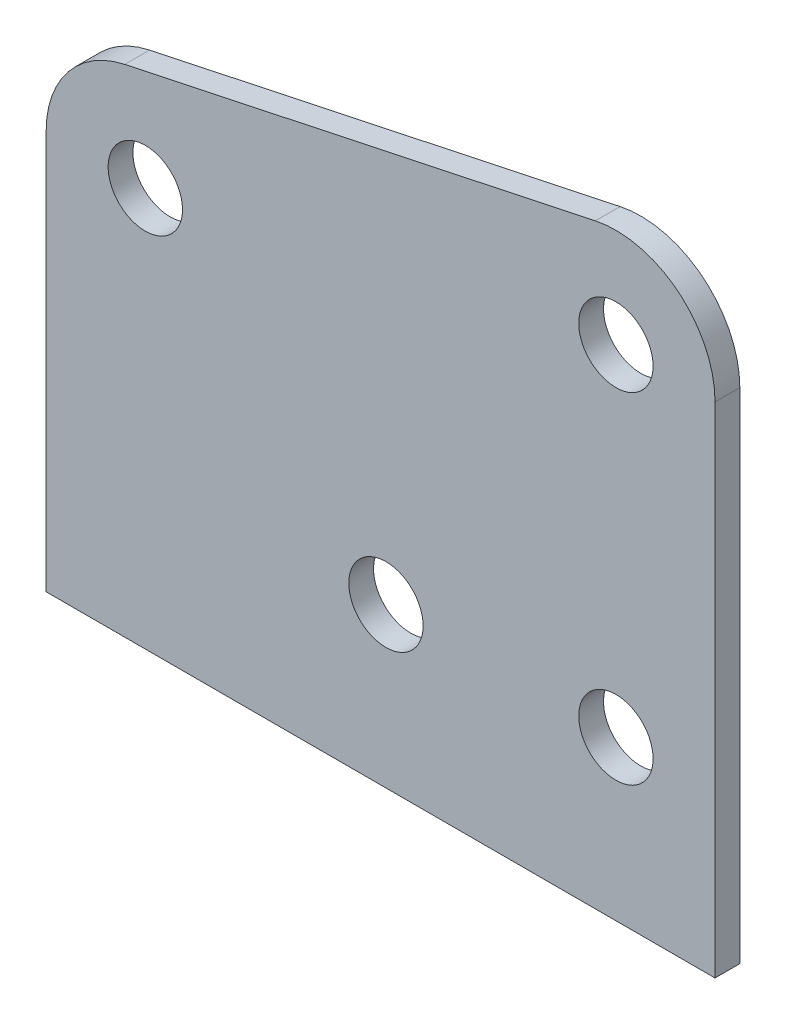
ISO-10303-21;
HEADER;
FILE_DESCRIPTION(('STEP AP214'),'2;1');
FILE_NAME('part.step','',(''),(''),'','','');
FILE_SCHEMA(('AUTOMOTIVE_DESIGN { 1 0 10303 214 1 1 1 1 }'));
ENDSEC;
DATA;
#1=APPLICATION_CONTEXT('core data for automotive mechanical design processes');
#2=APPLICATION_PROTOCOL_DEFINITION('international standard','automotive_design',2000,#1);
#3=PRODUCT_CONTEXT('',#1,'mechanical');
#4=PRODUCT('Part','Part','',(#3));
#5=PRODUCT_RELATED_PRODUCT_CATEGORY('part','',(#4));
#6=PRODUCT_DEFINITION_FORMATION('','',#4);
#7=PRODUCT_DEFINITION_CONTEXT('part definition',#1,'design');
#8=PRODUCT_DEFINITION('design','',#6,#7);
#9=PRODUCT_DEFINITION_SHAPE('','',#8);
#10=(LENGTH_UNIT() NAMED_UNIT(*) SI_UNIT(.MILLI.,.METRE.));
#11=(NAMED_UNIT(*) PLANE_ANGLE_UNIT() SI_UNIT($,.RADIAN.));
#12=(NAMED_UNIT(*) SI_UNIT($,.STERADIAN.) SOLID_ANGLE_UNIT());
#13=UNCERTAINTY_MEASURE_WITH_UNIT(LENGTH_MEASURE(1.E-05),#10,'distance_accuracy_value','');
#14=(GEOMETRIC_REPRESENTATION_CONTEXT(3) GLOBAL_UNCERTAINTY_ASSIGNED_CONTEXT((#13)) GLOBAL_UNIT_ASSIGNED_CONTEXT((#10,
#11,#12)) REPRESENTATION_CONTEXT('',''));
#15=CARTESIAN_POINT('',(0.,0.,0.));
#16=DIRECTION('',(0.,0.,1.));
#17=DIRECTION('',(1.,0.,0.));
#18=AXIS2_PLACEMENT_3D('',#15,#16,#17);
#19=CARTESIAN_POINT('',(20.6876756424581,63.91783,3.175));
#20=DIRECTION('',(0.,0.,1.));
#21=DIRECTION('',(1.,0.,0.));
#22=AXIS2_PLACEMENT_3D('',#19,#20,#21);
#23=PLANE('',#22);
#24=CARTESIAN_POINT('',(-8.77632435754189,20.35683,3.175));
#25=DIRECTION('',(0.,0.,1.));
#26=DIRECTION('',(1.,0.,0.));
#27=AXIS2_PLACEMENT_3D('',#24,#25,#26);
#28=CIRCLE('',#27,4.7625);
#29=CARTESIAN_POINT('',(-4.01382435754189,20.35683,3.175));
#30=VERTEX_POINT('',#29);
#31=EDGE_CURVE('E216',#30,#30,#28,.T.);
#32=ORIENTED_EDGE('',*,*,#31,.F.);
#33=EDGE_LOOP('',(#32));
#34=FACE_BOUND('',#33,.T.);
#35=CARTESIAN_POINT('',(20.6876756424581,20.35683,3.175));
#36=DIRECTION('',(0.,0.,1.));
#37=DIRECTION('',(1.,0.,0.));
#38=AXIS2_PLACEMENT_3D('',#35,#36,#37);
#39=CIRCLE('',#38,4.7625);
#40=CARTESIAN_POINT('',(25.4501756424581,20.35683,3.175));
#41=VERTEX_POINT('',#40);
#42=EDGE_CURVE('E138',#41,#41,#39,.T.);
#43=ORIENTED_EDGE('',*,*,#42,.F.);
#44=EDGE_LOOP('',(#43));
#45=FACE_BOUND('',#44,.T.);
#46=CARTESIAN_POINT('',(20.6876756424581,63.91783,3.175));
#47=DIRECTION('',(0.,0.,1.));
#48=DIRECTION('',(1.,0.,0.));
#49=AXIS2_PLACEMENT_3D('',#46,#47,#48);
#50=CIRCLE('',#49,12.7);
#51=CARTESIAN_POINT('',(33.3876756424581,63.91783,3.175));
#52=VERTEX_POINT('',#51);
#53=CARTESIAN_POINT('',(18.0529367853964,76.3415231367081,3.175));
#54=VERTEX_POINT('',#53);
#55=EDGE_CURVE('E150',#52,#54,#50,.T.);
#56=ORIENTED_EDGE('',*,*,#55,.T.);
#57=DIRECTION('',(-0.978243554071508,-0.207459752524545,0.));
#58=VECTOR('',#57,1.);
#59=CARTESIAN_POINT('',(18.0529367853964,76.3415231367081,3.175));
#60=LINE('',#59,#58);
#61=CARTESIAN_POINT('',(-42.2403132146036,63.5549091367081,3.175));
#62=VERTEX_POINT('',#61);
#63=EDGE_CURVE('E98',#54,#62,#60,.T.);
#64=ORIENTED_EDGE('',*,*,#63,.T.);
#65=CARTESIAN_POINT('',(-39.6055743575419,51.131216,3.175));
#66=DIRECTION('',(0.,0.,1.));
#67=DIRECTION('',(1.,0.,0.));
#68=AXIS2_PLACEMENT_3D('',#65,#66,#67);
#69=CIRCLE('',#68,12.7);
#70=CARTESIAN_POINT('',(-52.3055743575419,51.131216,3.175));
#71=VERTEX_POINT('',#70);
#72=EDGE_CURVE('E111',#62,#71,#69,.T.);
#73=ORIENTED_EDGE('',*,*,#72,.T.);
#74=DIRECTION('',(0.,-1.,0.));
#75=VECTOR('',#74,1.);
#76=CARTESIAN_POINT('',(-52.3055743575419,51.131216,3.175));
#77=LINE('',#76,#75);
#78=CARTESIAN_POINT('',(-52.3055743575419,0.,3.175));
#79=VERTEX_POINT('',#78);
#80=EDGE_CURVE('E105',#71,#79,#77,.T.);
#81=ORIENTED_EDGE('',*,*,#80,.T.);
#82=DIRECTION('',(1.,0.,0.));
#83=VECTOR('',#82,1.);
#84=CARTESIAN_POINT('',(-52.3055743575419,0.,3.175));
#85=LINE('',#84,#83);
#86=CARTESIAN_POINT('',(33.3876756424581,0.,3.175));
#87=VERTEX_POINT('',#86);
#88=EDGE_CURVE('E109',#79,#87,#85,.T.);
#89=ORIENTED_EDGE('',*,*,#88,.T.);
#90=DIRECTION('',(0.,1.,0.));
#91=VECTOR('',#90,1.);
#92=CARTESIAN_POINT('',(33.3876756424581,63.91783,3.175));
#93=LINE('',#92,#91);
#94=EDGE_CURVE('E61',#87,#52,#93,.T.);
#95=ORIENTED_EDGE('',*,*,#94,.T.);
#96=EDGE_LOOP('',(#56,#64,#73,#81,#89,#95));
#97=FACE_BOUND('',#96,.T.);
#98=CARTESIAN_POINT('',(20.6876756424581,63.91783,3.175));
#99=DIRECTION('',(0.,0.,1.));
#100=DIRECTION('',(1.,0.,0.));
#101=AXIS2_PLACEMENT_3D('',#98,#99,#100);
#102=CIRCLE('',#101,4.7625);
#103=CARTESIAN_POINT('',(25.4501756424581,63.91783,3.175));
#104=VERTEX_POINT('',#103);
#105=EDGE_CURVE('E224',#104,#104,#102,.T.);
#106=ORIENTED_EDGE('',*,*,#105,.F.);
#107=EDGE_LOOP('',(#106));
#108=FACE_BOUND('',#107,.T.);
#109=CARTESIAN_POINT('',(-39.6055743575419,51.131216,3.175));
#110=DIRECTION('',(0.,0.,1.));
#111=DIRECTION('',(1.,0.,0.));
#112=AXIS2_PLACEMENT_3D('',#109,#110,#111);
#113=CIRCLE('',#112,4.7625);
#114=CARTESIAN_POINT('',(-34.8430743575419,51.131216,3.175));
#115=VERTEX_POINT('',#114);
#116=EDGE_CURVE('E205',#115,#115,#113,.T.);
#117=ORIENTED_EDGE('',*,*,#116,.F.);
#118=EDGE_LOOP('',(#117));
#119=FACE_BOUND('',#118,.T.);
#120=ADVANCED_FACE('F43',(#34,#45,#97,#108,#119),#23,.T.);
#121=CARTESIAN_POINT('',(20.6876756424581,63.91783,0.));
#122=DIRECTION('',(0.,0.,1.));
#123=DIRECTION('',(1.,0.,0.));
#124=AXIS2_PLACEMENT_3D('',#121,#122,#123);
#125=PLANE('',#124);
#126=CARTESIAN_POINT('',(20.6876756424581,63.91783,0.));
#127=DIRECTION('',(0.,0.,1.));
#128=DIRECTION('',(1.,0.,0.));
#129=AXIS2_PLACEMENT_3D('',#126,#127,#128);
#130=CIRCLE('',#129,12.7);
#131=CARTESIAN_POINT('',(33.3876756424581,63.91783,0.));
#132=VERTEX_POINT('',#131);
#133=CARTESIAN_POINT('',(18.0529367853964,76.3415231367081,0.));
#134=VERTEX_POINT('',#133);
#135=EDGE_CURVE('E133',#132,#134,#130,.T.);
#136=ORIENTED_EDGE('',*,*,#135,.F.);
#137=DIRECTION('',(0.,1.,0.));
#138=VECTOR('',#137,1.);
#139=CARTESIAN_POINT('',(33.3876756424581,63.91783,0.));
#140=LINE('',#139,#138);
#141=CARTESIAN_POINT('',(33.3876756424581,0.,0.));
#142=VERTEX_POINT('',#141);
#143=EDGE_CURVE('E90',#142,#132,#140,.T.);
#144=ORIENTED_EDGE('',*,*,#143,.F.);
#145=DIRECTION('',(1.,0.,0.));
#146=VECTOR('',#145,1.);
#147=CARTESIAN_POINT('',(-52.3055743575419,0.,0.));
#148=LINE('',#147,#146);
#149=CARTESIAN_POINT('',(-52.3055743575419,0.,0.));
#150=VERTEX_POINT('',#149);
#151=EDGE_CURVE('E84',#150,#142,#148,.T.);
#152=ORIENTED_EDGE('',*,*,#151,.F.);
#153=DIRECTION('',(0.,-1.,0.));
#154=VECTOR('',#153,1.);
#155=CARTESIAN_POINT('',(-52.3055743575419,51.131216,0.));
#156=LINE('',#155,#154);
#157=CARTESIAN_POINT('',(-52.3055743575419,51.131216,0.));
#158=VERTEX_POINT('',#157);
#159=EDGE_CURVE('E120',#158,#150,#156,.T.);
#160=ORIENTED_EDGE('',*,*,#159,.F.);
#161=CARTESIAN_POINT('',(-39.6055743575419,51.131216,0.));
#162=DIRECTION('',(0.,0.,1.));
#163=DIRECTION('',(1.,0.,0.));
#164=AXIS2_PLACEMENT_3D('',#161,#162,#163);
#165=CIRCLE('',#164,12.7);
#166=CARTESIAN_POINT('',(-42.2403132146036,63.5549091367081,0.));
#167=VERTEX_POINT('',#166);
#168=EDGE_CURVE('E141',#167,#158,#165,.T.);
#169=ORIENTED_EDGE('',*,*,#168,.F.);
#170=DIRECTION('',(-0.978243554071508,-0.207459752524545,0.));
#171=VECTOR('',#170,1.);
#172=CARTESIAN_POINT('',(18.0529367853964,76.3415231367081,0.));
#173=LINE('',#172,#171);
#174=EDGE_CURVE('E137',#134,#167,#173,.T.);
#175=ORIENTED_EDGE('',*,*,#174,.F.);
#176=EDGE_LOOP('',(#136,#144,#152,#160,#169,#175));
#177=FACE_BOUND('',#176,.T.);
#178=CARTESIAN_POINT('',(20.6876756424581,20.35683,0.));
#179=DIRECTION('',(0.,0.,1.));
#180=DIRECTION('',(1.,0.,0.));
#181=AXIS2_PLACEMENT_3D('',#178,#179,#180);
#182=CIRCLE('',#181,4.7625);
#183=CARTESIAN_POINT('',(25.4501756424581,20.35683,0.));
#184=VERTEX_POINT('',#183);
#185=EDGE_CURVE('E228',#184,#184,#182,.T.);
#186=ORIENTED_EDGE('',*,*,#185,.T.);
#187=EDGE_LOOP('',(#186));
#188=FACE_BOUND('',#187,.T.);
#189=CARTESIAN_POINT('',(20.6876756424581,63.91783,0.));
#190=DIRECTION('',(0.,0.,1.));
#191=DIRECTION('',(1.,0.,0.));
#192=AXIS2_PLACEMENT_3D('',#189,#190,#191);
#193=CIRCLE('',#192,4.7625);
#194=CARTESIAN_POINT('',(25.4501756424581,63.91783,0.));
#195=VERTEX_POINT('',#194);
#196=EDGE_CURVE('E220',#195,#195,#193,.T.);
#197=ORIENTED_EDGE('',*,*,#196,.T.);
#198=EDGE_LOOP('',(#197));
#199=FACE_BOUND('',#198,.T.);
#200=CARTESIAN_POINT('',(-8.77632435754189,20.35683,0.));
#201=DIRECTION('',(0.,0.,1.));
#202=DIRECTION('',(1.,0.,0.));
#203=AXIS2_PLACEMENT_3D('',#200,#201,#202);
#204=CIRCLE('',#203,4.7625);
#205=CARTESIAN_POINT('',(-4.01382435754189,20.35683,0.));
#206=VERTEX_POINT('',#205);
#207=EDGE_CURVE('E213',#206,#206,#204,.T.);
#208=ORIENTED_EDGE('',*,*,#207,.T.);
#209=EDGE_LOOP('',(#208));
#210=FACE_BOUND('',#209,.T.);
#211=CARTESIAN_POINT('',(-39.6055743575419,51.131216,0.));
#212=DIRECTION('',(0.,0.,1.));
#213=DIRECTION('',(1.,0.,0.));
#214=AXIS2_PLACEMENT_3D('',#211,#212,#213);
#215=CIRCLE('',#214,4.7625);
#216=CARTESIAN_POINT('',(-34.8430743575419,51.131216,0.));
#217=VERTEX_POINT('',#216);
#218=EDGE_CURVE('E208',#217,#217,#215,.T.);
#219=ORIENTED_EDGE('',*,*,#218,.T.);
#220=EDGE_LOOP('',(#219));
#221=FACE_BOUND('',#220,.T.);
#222=ADVANCED_FACE('F163',(#177,#188,#199,#210,#221),#125,.F.);
#223=CARTESIAN_POINT('',(20.6876756424581,63.91783,3.175));
#224=DIRECTION('',(0.,0.,-1.));
#225=DIRECTION('',(-1.,0.,0.));
#226=AXIS2_PLACEMENT_3D('',#223,#224,#225);
#227=CYLINDRICAL_SURFACE('',#226,12.7);
#228=ORIENTED_EDGE('',*,*,#135,.T.);
#229=DIRECTION('',(0.,0.,-1.));
#230=VECTOR('',#229,1.);
#231=CARTESIAN_POINT('',(18.0529367853964,76.3415231367081,3.175));
#232=LINE('',#231,#230);
#233=EDGE_CURVE('E11',#54,#134,#232,.T.);
#234=ORIENTED_EDGE('',*,*,#233,.F.);
#235=ORIENTED_EDGE('',*,*,#55,.F.);
#236=DIRECTION('',(0.,0.,-1.));
#237=VECTOR('',#236,1.);
#238=CARTESIAN_POINT('',(33.3876756424581,63.91783,3.175));
#239=LINE('',#238,#237);
#240=EDGE_CURVE('E129',#52,#132,#239,.T.);
#241=ORIENTED_EDGE('',*,*,#240,.T.);
#242=EDGE_LOOP('',(#228,#234,#235,#241));
#243=FACE_BOUND('',#242,.T.);
#244=ADVANCED_FACE('F45',(#243),#227,.T.);
#245=CARTESIAN_POINT('',(18.0529367853964,76.3415231367081,3.175));
#246=DIRECTION('',(0.207459752524545,-0.978243554071508,0.));
#247=DIRECTION('',(0.978243554071508,0.207459752524545,0.));
#248=AXIS2_PLACEMENT_3D('',#245,#246,#247);
#249=PLANE('',#248);
#250=ORIENTED_EDGE('',*,*,#174,.T.);
#251=DIRECTION('',(0.,0.,-1.));
#252=VECTOR('',#251,1.);
#253=CARTESIAN_POINT('',(-42.2403132146036,63.5549091367081,3.175));
#254=LINE('',#253,#252);
#255=EDGE_CURVE('E53',#62,#167,#254,.T.);
#256=ORIENTED_EDGE('',*,*,#255,.F.);
#257=ORIENTED_EDGE('',*,*,#63,.F.);
#258=ORIENTED_EDGE('',*,*,#233,.T.);
#259=EDGE_LOOP('',(#250,#256,#257,#258));
#260=FACE_BOUND('',#259,.T.);
#261=ADVANCED_FACE('F296',(#260),#249,.F.);
#262=CARTESIAN_POINT('',(-39.6055743575419,51.131216,3.175));
#263=DIRECTION('',(0.,0.,-1.));
#264=DIRECTION('',(-1.,0.,0.));
#265=AXIS2_PLACEMENT_3D('',#262,#263,#264);
#266=CYLINDRICAL_SURFACE('',#265,12.7);
#267=ORIENTED_EDGE('',*,*,#168,.T.);
#268=DIRECTION('',(0.,0.,-1.));
#269=VECTOR('',#268,1.);
#270=CARTESIAN_POINT('',(-52.3055743575419,51.131216,3.175));
#271=LINE('',#270,#269);
#272=EDGE_CURVE('E122',#71,#158,#271,.T.);
#273=ORIENTED_EDGE('',*,*,#272,.F.);
#274=ORIENTED_EDGE('',*,*,#72,.F.);
#275=ORIENTED_EDGE('',*,*,#255,.T.);
#276=EDGE_LOOP('',(#267,#273,#274,#275));
#277=FACE_BOUND('',#276,.T.);
#278=ADVANCED_FACE('F160',(#277),#266,.T.);
#279=CARTESIAN_POINT('',(-52.3055743575419,51.131216,3.175));
#280=DIRECTION('',(1.,0.,0.));
#281=DIRECTION('',(0.,0.,-1.));
#282=AXIS2_PLACEMENT_3D('',#279,#280,#281);
#283=PLANE('',#282);
#284=ORIENTED_EDGE('',*,*,#159,.T.);
#285=DIRECTION('',(0.,0.,-1.));
#286=VECTOR('',#285,1.);
#287=CARTESIAN_POINT('',(-52.3055743575419,0.,3.175));
#288=LINE('',#287,#286);
#289=EDGE_CURVE('E117',#79,#150,#288,.T.);
#290=ORIENTED_EDGE('',*,*,#289,.F.);
#291=ORIENTED_EDGE('',*,*,#80,.F.);
#292=ORIENTED_EDGE('',*,*,#272,.T.);
#293=EDGE_LOOP('',(#284,#290,#291,#292));
#294=FACE_BOUND('',#293,.T.);
#295=ADVANCED_FACE('F118',(#294),#283,.F.);
#296=CARTESIAN_POINT('',(-52.3055743575419,0.,3.175));
#297=DIRECTION('',(0.,1.,0.));
#298=DIRECTION('',(0.,0.,1.));
#299=AXIS2_PLACEMENT_3D('',#296,#297,#298);
#300=PLANE('',#299);
#301=ORIENTED_EDGE('',*,*,#151,.T.);
#302=DIRECTION('',(0.,0.,-1.));
#303=VECTOR('',#302,1.);
#304=CARTESIAN_POINT('',(33.3876756424581,0.,3.175));
#305=LINE('',#304,#303);
#306=EDGE_CURVE('E123',#87,#142,#305,.T.);
#307=ORIENTED_EDGE('',*,*,#306,.F.);
#308=ORIENTED_EDGE('',*,*,#88,.F.);
#309=ORIENTED_EDGE('',*,*,#289,.T.);
#310=EDGE_LOOP('',(#301,#307,#308,#309));
#311=FACE_BOUND('',#310,.T.);
#312=ADVANCED_FACE('F125',(#311),#300,.F.);
#313=CARTESIAN_POINT('',(33.3876756424581,63.91783,3.175));
#314=DIRECTION('',(-1.,0.,0.));
#315=DIRECTION('',(0.,0.,1.));
#316=AXIS2_PLACEMENT_3D('',#313,#314,#315);
#317=PLANE('',#316);
#318=ORIENTED_EDGE('',*,*,#143,.T.);
#319=ORIENTED_EDGE('',*,*,#240,.F.);
#320=ORIENTED_EDGE('',*,*,#94,.F.);
#321=ORIENTED_EDGE('',*,*,#306,.T.);
#322=EDGE_LOOP('',(#318,#319,#320,#321));
#323=FACE_BOUND('',#322,.T.);
#324=ADVANCED_FACE('F168',(#323),#317,.F.);
#325=CARTESIAN_POINT('',(20.6876756424581,20.35683,3.175));
#326=DIRECTION('',(0.,0.,-1.));
#327=DIRECTION('',(-1.,0.,0.));
#328=AXIS2_PLACEMENT_3D('',#325,#326,#327);
#329=CYLINDRICAL_SURFACE('',#328,4.7625);
#330=ORIENTED_EDGE('',*,*,#42,.T.);
#331=EDGE_LOOP('',(#330));
#332=FACE_BOUND('',#331,.T.);
#333=ORIENTED_EDGE('',*,*,#185,.F.);
#334=EDGE_LOOP('',(#333));
#335=FACE_BOUND('',#334,.T.);
#336=ADVANCED_FACE('F170',(#332,#335),#329,.F.);
#337=CARTESIAN_POINT('',(20.6876756424581,63.91783,3.175));
#338=DIRECTION('',(0.,0.,-1.));
#339=DIRECTION('',(-1.,0.,0.));
#340=AXIS2_PLACEMENT_3D('',#337,#338,#339);
#341=CYLINDRICAL_SURFACE('',#340,4.7625);
#342=ORIENTED_EDGE('',*,*,#105,.T.);
#343=EDGE_LOOP('',(#342));
#344=FACE_BOUND('',#343,.T.);
#345=ORIENTED_EDGE('',*,*,#196,.F.);
#346=EDGE_LOOP('',(#345));
#347=FACE_BOUND('',#346,.T.);
#348=ADVANCED_FACE('F176',(#344,#347),#341,.F.);
#349=CARTESIAN_POINT('',(-8.77632435754189,20.35683,3.175));
#350=DIRECTION('',(0.,0.,-1.));
#351=DIRECTION('',(-1.,0.,0.));
#352=AXIS2_PLACEMENT_3D('',#349,#350,#351);
#353=CYLINDRICAL_SURFACE('',#352,4.7625);
#354=ORIENTED_EDGE('',*,*,#31,.T.);
#355=EDGE_LOOP('',(#354));
#356=FACE_BOUND('',#355,.T.);
#357=ORIENTED_EDGE('',*,*,#207,.F.);
#358=EDGE_LOOP('',(#357));
#359=FACE_BOUND('',#358,.T.);
#360=ADVANCED_FACE('F192',(#356,#359),#353,.F.);
#361=CARTESIAN_POINT('',(-39.6055743575419,51.131216,3.175));
#362=DIRECTION('',(0.,0.,-1.));
#363=DIRECTION('',(-1.,0.,0.));
#364=AXIS2_PLACEMENT_3D('',#361,#362,#363);
#365=CYLINDRICAL_SURFACE('',#364,4.7625);
#366=ORIENTED_EDGE('',*,*,#116,.T.);
#367=EDGE_LOOP('',(#366));
#368=FACE_BOUND('',#367,.T.);
#369=ORIENTED_EDGE('',*,*,#218,.F.);
#370=EDGE_LOOP('',(#369));
#371=FACE_BOUND('',#370,.T.);
#372=ADVANCED_FACE('F196',(#368,#371),#365,.F.);
#373=CLOSED_SHELL('',(#120,#222,#244,#261,#278,#295,#312,#324,#336,#348,#360,#372));
#374=MANIFOLD_SOLID_BREP('B2',#373);
#375=ADVANCED_BREP_SHAPE_REPRESENTATION('',(#18,#374),#14);
#376=SHAPE_DEFINITION_REPRESENTATION(#9,#375);
ENDSEC;
END-ISO-10303-21;
